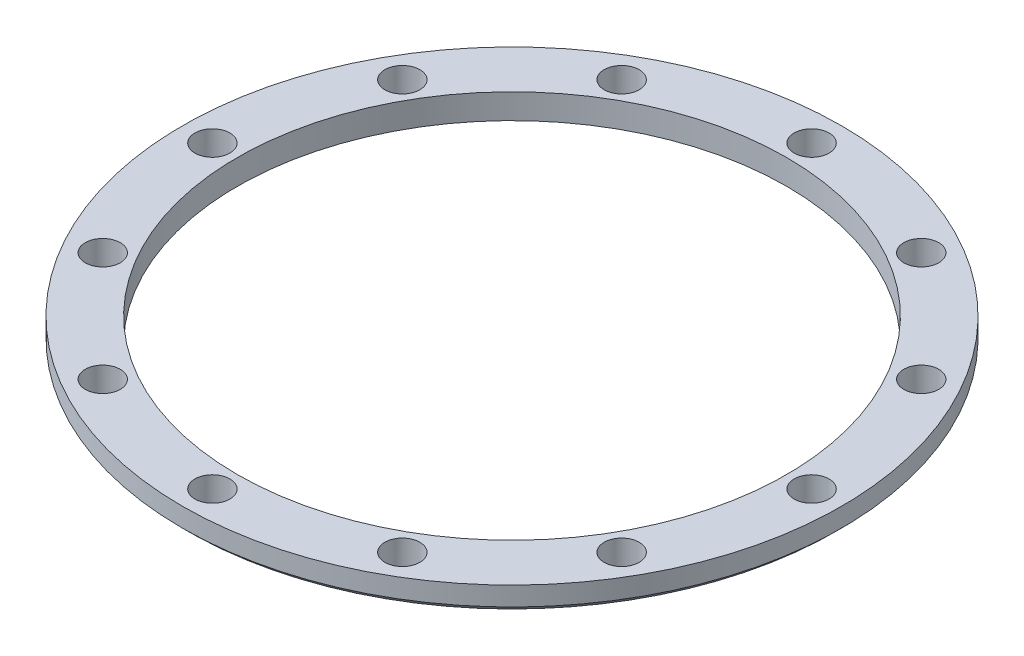
ISO-10303-21;
HEADER;
FILE_DESCRIPTION(('STEP AP214'),'2;1');
FILE_NAME('part.step','',(''),(''),'','','');
FILE_SCHEMA(('AUTOMOTIVE_DESIGN { 1 0 10303 214 1 1 1 1 }'));
ENDSEC;
DATA;
#1=APPLICATION_CONTEXT('core data for automotive mechanical design processes');
#2=APPLICATION_PROTOCOL_DEFINITION('international standard','automotive_design',2000,#1);
#3=PRODUCT_CONTEXT('',#1,'mechanical');
#4=PRODUCT('Part','Part','',(#3));
#5=PRODUCT_RELATED_PRODUCT_CATEGORY('part','',(#4));
#6=PRODUCT_DEFINITION_FORMATION('','',#4);
#7=PRODUCT_DEFINITION_CONTEXT('part definition',#1,'design');
#8=PRODUCT_DEFINITION('design','',#6,#7);
#9=PRODUCT_DEFINITION_SHAPE('','',#8);
#10=(LENGTH_UNIT() NAMED_UNIT(*) SI_UNIT(.MILLI.,.METRE.));
#11=(NAMED_UNIT(*) PLANE_ANGLE_UNIT() SI_UNIT($,.RADIAN.));
#12=(NAMED_UNIT(*) SI_UNIT($,.STERADIAN.) SOLID_ANGLE_UNIT());
#13=UNCERTAINTY_MEASURE_WITH_UNIT(LENGTH_MEASURE(1.E-05),#10,'distance_accuracy_value','');
#14=(GEOMETRIC_REPRESENTATION_CONTEXT(3) GLOBAL_UNCERTAINTY_ASSIGNED_CONTEXT((#13)) GLOBAL_UNIT_ASSIGNED_CONTEXT((#10,
#11,#12)) REPRESENTATION_CONTEXT('',''));
#15=CARTESIAN_POINT('',(0.,0.,0.));
#16=DIRECTION('',(0.,0.,1.));
#17=DIRECTION('',(1.,0.,0.));
#18=AXIS2_PLACEMENT_3D('',#15,#16,#17);
#19=CARTESIAN_POINT('',(15.,-43.,25.9807621135332));
#20=DIRECTION('',(0.,1.,0.));
#21=DIRECTION('',(0.,0.,1.));
#22=AXIS2_PLACEMENT_3D('',#19,#20,#21);
#23=CYLINDRICAL_SURFACE('',#22,1.75000000000326);
#24=CARTESIAN_POINT('',(15.,-43.,25.9807621135332));
#25=DIRECTION('',(0.,-1.,0.));
#26=DIRECTION('',(0.,0.,-1.));
#27=AXIS2_PLACEMENT_3D('',#24,#25,#26);
#28=CIRCLE('',#27,1.75000000000326);
#29=CARTESIAN_POINT('',(15.,-43.,24.2307621135299));
#30=VERTEX_POINT('',#29);
#31=EDGE_CURVE('E42',#30,#30,#28,.T.);
#32=ORIENTED_EDGE('',*,*,#31,.T.);
#33=EDGE_LOOP('',(#32));
#34=FACE_BOUND('',#33,.T.);
#35=CARTESIAN_POINT('',(15.,-40.5,25.9807621135332));
#36=DIRECTION('',(0.,1.,0.));
#37=DIRECTION('',(0.,0.,1.));
#38=AXIS2_PLACEMENT_3D('',#35,#36,#37);
#39=CIRCLE('',#38,1.75000000000326);
#40=CARTESIAN_POINT('',(15.,-40.5,27.7307621135364));
#41=VERTEX_POINT('',#40);
#42=EDGE_CURVE('E89',#41,#41,#39,.T.);
#43=ORIENTED_EDGE('',*,*,#42,.T.);
#44=EDGE_LOOP('',(#43));
#45=FACE_BOUND('',#44,.T.);
#46=ADVANCED_FACE('F31',(#34,#45),#23,.F.);
#47=CARTESIAN_POINT('',(25.9807621135332,-43.,15.));
#48=DIRECTION('',(0.,1.,0.));
#49=DIRECTION('',(0.,0.,1.));
#50=AXIS2_PLACEMENT_3D('',#47,#48,#49);
#51=CYLINDRICAL_SURFACE('',#50,1.75000000000326);
#52=CARTESIAN_POINT('',(25.9807621135332,-43.,15.));
#53=DIRECTION('',(0.,-1.,0.));
#54=DIRECTION('',(0.,0.,-1.));
#55=AXIS2_PLACEMENT_3D('',#52,#53,#54);
#56=CIRCLE('',#55,1.75000000000326);
#57=CARTESIAN_POINT('',(25.9807621135332,-43.,13.2499999999967));
#58=VERTEX_POINT('',#57);
#59=EDGE_CURVE('E46',#58,#58,#56,.T.);
#60=ORIENTED_EDGE('',*,*,#59,.T.);
#61=EDGE_LOOP('',(#60));
#62=FACE_BOUND('',#61,.T.);
#63=CARTESIAN_POINT('',(25.9807621135332,-40.5,15.));
#64=DIRECTION('',(0.,1.,0.));
#65=DIRECTION('',(0.,0.,1.));
#66=AXIS2_PLACEMENT_3D('',#63,#64,#65);
#67=CIRCLE('',#66,1.75000000000326);
#68=CARTESIAN_POINT('',(25.9807621135332,-40.5,16.7500000000033));
#69=VERTEX_POINT('',#68);
#70=EDGE_CURVE('E92',#69,#69,#67,.T.);
#71=ORIENTED_EDGE('',*,*,#70,.T.);
#72=EDGE_LOOP('',(#71));
#73=FACE_BOUND('',#72,.T.);
#74=ADVANCED_FACE('F141',(#62,#73),#51,.F.);
#75=CARTESIAN_POINT('',(30.,-43.,0.));
#76=DIRECTION('',(0.,1.,0.));
#77=DIRECTION('',(0.,0.,1.));
#78=AXIS2_PLACEMENT_3D('',#75,#76,#77);
#79=CYLINDRICAL_SURFACE('',#78,1.75000000000326);
#80=CARTESIAN_POINT('',(30.,-43.,0.));
#81=DIRECTION('',(0.,-1.,0.));
#82=DIRECTION('',(0.,0.,-1.));
#83=AXIS2_PLACEMENT_3D('',#80,#81,#82);
#84=CIRCLE('',#83,1.75000000000326);
#85=CARTESIAN_POINT('',(30.,-43.,-1.75000000000327));
#86=VERTEX_POINT('',#85);
#87=EDGE_CURVE('E56',#86,#86,#84,.T.);
#88=ORIENTED_EDGE('',*,*,#87,.T.);
#89=EDGE_LOOP('',(#88));
#90=FACE_BOUND('',#89,.T.);
#91=CARTESIAN_POINT('',(30.,-40.5,0.));
#92=DIRECTION('',(0.,1.,0.));
#93=DIRECTION('',(0.,0.,1.));
#94=AXIS2_PLACEMENT_3D('',#91,#92,#93);
#95=CIRCLE('',#94,1.75000000000326);
#96=CARTESIAN_POINT('',(30.,-40.5,1.75000000000326));
#97=VERTEX_POINT('',#96);
#98=EDGE_CURVE('E95',#97,#97,#95,.T.);
#99=ORIENTED_EDGE('',*,*,#98,.T.);
#100=EDGE_LOOP('',(#99));
#101=FACE_BOUND('',#100,.T.);
#102=ADVANCED_FACE('F147',(#90,#101),#79,.F.);
#103=CARTESIAN_POINT('',(25.9807621135332,-43.,-15.));
#104=DIRECTION('',(0.,1.,0.));
#105=DIRECTION('',(0.,0.,1.));
#106=AXIS2_PLACEMENT_3D('',#103,#104,#105);
#107=CYLINDRICAL_SURFACE('',#106,1.75000000000326);
#108=CARTESIAN_POINT('',(25.9807621135332,-43.,-15.));
#109=DIRECTION('',(0.,-1.,0.));
#110=DIRECTION('',(0.,0.,-1.));
#111=AXIS2_PLACEMENT_3D('',#108,#109,#110);
#112=CIRCLE('',#111,1.75000000000326);
#113=CARTESIAN_POINT('',(25.9807621135332,-43.,-16.7500000000033));
#114=VERTEX_POINT('',#113);
#115=EDGE_CURVE('E59',#114,#114,#112,.T.);
#116=ORIENTED_EDGE('',*,*,#115,.T.);
#117=EDGE_LOOP('',(#116));
#118=FACE_BOUND('',#117,.T.);
#119=CARTESIAN_POINT('',(25.9807621135332,-40.5,-15.));
#120=DIRECTION('',(0.,1.,0.));
#121=DIRECTION('',(0.,0.,1.));
#122=AXIS2_PLACEMENT_3D('',#119,#120,#121);
#123=CIRCLE('',#122,1.75000000000326);
#124=CARTESIAN_POINT('',(25.9807621135332,-40.5,-13.2499999999967));
#125=VERTEX_POINT('',#124);
#126=EDGE_CURVE('E98',#125,#125,#123,.T.);
#127=ORIENTED_EDGE('',*,*,#126,.T.);
#128=EDGE_LOOP('',(#127));
#129=FACE_BOUND('',#128,.T.);
#130=ADVANCED_FACE('F228',(#118,#129),#107,.F.);
#131=CARTESIAN_POINT('',(15.,-43.,-25.9807621135332));
#132=DIRECTION('',(0.,1.,0.));
#133=DIRECTION('',(0.,0.,1.));
#134=AXIS2_PLACEMENT_3D('',#131,#132,#133);
#135=CYLINDRICAL_SURFACE('',#134,1.75000000000326);
#136=CARTESIAN_POINT('',(15.,-43.,-25.9807621135332));
#137=DIRECTION('',(0.,-1.,0.));
#138=DIRECTION('',(0.,0.,-1.));
#139=AXIS2_PLACEMENT_3D('',#136,#137,#138);
#140=CIRCLE('',#139,1.75000000000326);
#141=CARTESIAN_POINT('',(15.,-43.,-27.7307621135364));
#142=VERTEX_POINT('',#141);
#143=EDGE_CURVE('E62',#142,#142,#140,.T.);
#144=ORIENTED_EDGE('',*,*,#143,.T.);
#145=EDGE_LOOP('',(#144));
#146=FACE_BOUND('',#145,.T.);
#147=CARTESIAN_POINT('',(15.,-40.5,-25.9807621135332));
#148=DIRECTION('',(0.,1.,0.));
#149=DIRECTION('',(0.,0.,1.));
#150=AXIS2_PLACEMENT_3D('',#147,#148,#149);
#151=CIRCLE('',#150,1.75000000000326);
#152=CARTESIAN_POINT('',(15.,-40.5,-24.2307621135299));
#153=VERTEX_POINT('',#152);
#154=EDGE_CURVE('E101',#153,#153,#151,.T.);
#155=ORIENTED_EDGE('',*,*,#154,.T.);
#156=EDGE_LOOP('',(#155));
#157=FACE_BOUND('',#156,.T.);
#158=ADVANCED_FACE('F224',(#146,#157),#135,.F.);
#159=CARTESIAN_POINT('',(0.,-43.,0.));
#160=DIRECTION('',(0.,1.,0.));
#161=DIRECTION('',(0.,0.,1.));
#162=AXIS2_PLACEMENT_3D('',#159,#160,#161);
#163=CYLINDRICAL_SURFACE('',#162,27.5);
#164=CARTESIAN_POINT('',(0.,-43.,0.));
#165=DIRECTION('',(0.,-1.,0.));
#166=DIRECTION('',(0.,0.,-1.));
#167=AXIS2_PLACEMENT_3D('',#164,#165,#166);
#168=CIRCLE('',#167,27.5);
#169=CARTESIAN_POINT('',(0.,-43.,-27.5));
#170=VERTEX_POINT('',#169);
#171=EDGE_CURVE('E65',#170,#170,#168,.T.);
#172=ORIENTED_EDGE('',*,*,#171,.T.);
#173=EDGE_LOOP('',(#172));
#174=FACE_BOUND('',#173,.T.);
#175=CARTESIAN_POINT('',(0.,-40.5,0.));
#176=DIRECTION('',(0.,1.,0.));
#177=DIRECTION('',(0.,0.,1.));
#178=AXIS2_PLACEMENT_3D('',#175,#176,#177);
#179=CIRCLE('',#178,27.5);
#180=CARTESIAN_POINT('',(0.,-40.5,27.5));
#181=VERTEX_POINT('',#180);
#182=EDGE_CURVE('E104',#181,#181,#179,.T.);
#183=ORIENTED_EDGE('',*,*,#182,.T.);
#184=EDGE_LOOP('',(#183));
#185=FACE_BOUND('',#184,.T.);
#186=ADVANCED_FACE('F220',(#174,#185),#163,.F.);
#187=CARTESIAN_POINT('',(0.,-43.,30.));
#188=DIRECTION('',(0.,1.,0.));
#189=DIRECTION('',(0.,0.,1.));
#190=AXIS2_PLACEMENT_3D('',#187,#188,#189);
#191=CYLINDRICAL_SURFACE('',#190,1.75000000000326);
#192=CARTESIAN_POINT('',(0.,-43.,30.));
#193=DIRECTION('',(0.,-1.,0.));
#194=DIRECTION('',(0.,0.,-1.));
#195=AXIS2_PLACEMENT_3D('',#192,#193,#194);
#196=CIRCLE('',#195,1.75000000000326);
#197=CARTESIAN_POINT('',(0.,-43.,28.2499999999967));
#198=VERTEX_POINT('',#197);
#199=EDGE_CURVE('E68',#198,#198,#196,.T.);
#200=ORIENTED_EDGE('',*,*,#199,.T.);
#201=EDGE_LOOP('',(#200));
#202=FACE_BOUND('',#201,.T.);
#203=CARTESIAN_POINT('',(0.,-40.5,30.));
#204=DIRECTION('',(0.,1.,0.));
#205=DIRECTION('',(0.,0.,1.));
#206=AXIS2_PLACEMENT_3D('',#203,#204,#205);
#207=CIRCLE('',#206,1.75000000000326);
#208=CARTESIAN_POINT('',(0.,-40.5,31.7500000000033));
#209=VERTEX_POINT('',#208);
#210=EDGE_CURVE('E107',#209,#209,#207,.T.);
#211=ORIENTED_EDGE('',*,*,#210,.T.);
#212=EDGE_LOOP('',(#211));
#213=FACE_BOUND('',#212,.T.);
#214=ADVANCED_FACE('F216',(#202,#213),#191,.F.);
#215=CARTESIAN_POINT('',(0.,-43.,-30.));
#216=DIRECTION('',(0.,1.,0.));
#217=DIRECTION('',(0.,0.,1.));
#218=AXIS2_PLACEMENT_3D('',#215,#216,#217);
#219=CYLINDRICAL_SURFACE('',#218,1.75000000000326);
#220=CARTESIAN_POINT('',(0.,-43.,-30.));
#221=DIRECTION('',(0.,-1.,0.));
#222=DIRECTION('',(0.,0.,-1.));
#223=AXIS2_PLACEMENT_3D('',#220,#221,#222);
#224=CIRCLE('',#223,1.75000000000326);
#225=CARTESIAN_POINT('',(0.,-43.,-31.7500000000033));
#226=VERTEX_POINT('',#225);
#227=EDGE_CURVE('E71',#226,#226,#224,.T.);
#228=ORIENTED_EDGE('',*,*,#227,.T.);
#229=EDGE_LOOP('',(#228));
#230=FACE_BOUND('',#229,.T.);
#231=CARTESIAN_POINT('',(0.,-40.5,-30.));
#232=DIRECTION('',(0.,1.,0.));
#233=DIRECTION('',(0.,0.,1.));
#234=AXIS2_PLACEMENT_3D('',#231,#232,#233);
#235=CIRCLE('',#234,1.75000000000326);
#236=CARTESIAN_POINT('',(0.,-40.5,-28.2499999999967));
#237=VERTEX_POINT('',#236);
#238=EDGE_CURVE('E110',#237,#237,#235,.T.);
#239=ORIENTED_EDGE('',*,*,#238,.T.);
#240=EDGE_LOOP('',(#239));
#241=FACE_BOUND('',#240,.T.);
#242=ADVANCED_FACE('F212',(#230,#241),#219,.F.);
#243=CARTESIAN_POINT('',(-15.,-43.,-25.9807621135332));
#244=DIRECTION('',(0.,1.,0.));
#245=DIRECTION('',(0.,0.,1.));
#246=AXIS2_PLACEMENT_3D('',#243,#244,#245);
#247=CYLINDRICAL_SURFACE('',#246,1.75000000000326);
#248=CARTESIAN_POINT('',(-15.,-43.,-25.9807621135332));
#249=DIRECTION('',(0.,-1.,0.));
#250=DIRECTION('',(0.,0.,-1.));
#251=AXIS2_PLACEMENT_3D('',#248,#249,#250);
#252=CIRCLE('',#251,1.75000000000326);
#253=CARTESIAN_POINT('',(-15.,-43.,-27.7307621135364));
#254=VERTEX_POINT('',#253);
#255=EDGE_CURVE('E74',#254,#254,#252,.T.);
#256=ORIENTED_EDGE('',*,*,#255,.T.);
#257=EDGE_LOOP('',(#256));
#258=FACE_BOUND('',#257,.T.);
#259=CARTESIAN_POINT('',(-15.,-40.5,-25.9807621135332));
#260=DIRECTION('',(0.,1.,0.));
#261=DIRECTION('',(0.,0.,1.));
#262=AXIS2_PLACEMENT_3D('',#259,#260,#261);
#263=CIRCLE('',#262,1.75000000000326);
#264=CARTESIAN_POINT('',(-15.,-40.5,-24.2307621135299));
#265=VERTEX_POINT('',#264);
#266=EDGE_CURVE('E113',#265,#265,#263,.T.);
#267=ORIENTED_EDGE('',*,*,#266,.T.);
#268=EDGE_LOOP('',(#267));
#269=FACE_BOUND('',#268,.T.);
#270=ADVANCED_FACE('F208',(#258,#269),#247,.F.);
#271=CARTESIAN_POINT('',(-25.9807621135332,-43.,-15.));
#272=DIRECTION('',(0.,1.,0.));
#273=DIRECTION('',(0.,0.,1.));
#274=AXIS2_PLACEMENT_3D('',#271,#272,#273);
#275=CYLINDRICAL_SURFACE('',#274,1.75000000000326);
#276=CARTESIAN_POINT('',(-25.9807621135332,-43.,-15.));
#277=DIRECTION('',(0.,-1.,0.));
#278=DIRECTION('',(0.,0.,-1.));
#279=AXIS2_PLACEMENT_3D('',#276,#277,#278);
#280=CIRCLE('',#279,1.75000000000326);
#281=CARTESIAN_POINT('',(-25.9807621135332,-43.,-16.7500000000033));
#282=VERTEX_POINT('',#281);
#283=EDGE_CURVE('E77',#282,#282,#280,.T.);
#284=ORIENTED_EDGE('',*,*,#283,.T.);
#285=EDGE_LOOP('',(#284));
#286=FACE_BOUND('',#285,.T.);
#287=CARTESIAN_POINT('',(-25.9807621135332,-40.5,-15.));
#288=DIRECTION('',(0.,1.,0.));
#289=DIRECTION('',(0.,0.,1.));
#290=AXIS2_PLACEMENT_3D('',#287,#288,#289);
#291=CIRCLE('',#290,1.75000000000326);
#292=CARTESIAN_POINT('',(-25.9807621135332,-40.5,-13.2499999999967));
#293=VERTEX_POINT('',#292);
#294=EDGE_CURVE('E116',#293,#293,#291,.T.);
#295=ORIENTED_EDGE('',*,*,#294,.T.);
#296=EDGE_LOOP('',(#295));
#297=FACE_BOUND('',#296,.T.);
#298=ADVANCED_FACE('F193',(#286,#297),#275,.F.);
#299=CARTESIAN_POINT('',(-30.,-43.,0.));
#300=DIRECTION('',(0.,1.,0.));
#301=DIRECTION('',(0.,0.,1.));
#302=AXIS2_PLACEMENT_3D('',#299,#300,#301);
#303=CYLINDRICAL_SURFACE('',#302,1.75000000000326);
#304=CARTESIAN_POINT('',(-30.,-43.,0.));
#305=DIRECTION('',(0.,-1.,0.));
#306=DIRECTION('',(0.,0.,-1.));
#307=AXIS2_PLACEMENT_3D('',#304,#305,#306);
#308=CIRCLE('',#307,1.75000000000326);
#309=CARTESIAN_POINT('',(-30.,-43.,-1.75000000000327));
#310=VERTEX_POINT('',#309);
#311=EDGE_CURVE('E80',#310,#310,#308,.T.);
#312=ORIENTED_EDGE('',*,*,#311,.T.);
#313=EDGE_LOOP('',(#312));
#314=FACE_BOUND('',#313,.T.);
#315=CARTESIAN_POINT('',(-30.,-40.5,0.));
#316=DIRECTION('',(0.,1.,0.));
#317=DIRECTION('',(0.,0.,1.));
#318=AXIS2_PLACEMENT_3D('',#315,#316,#317);
#319=CIRCLE('',#318,1.75000000000326);
#320=CARTESIAN_POINT('',(-30.,-40.5,1.75000000000326));
#321=VERTEX_POINT('',#320);
#322=EDGE_CURVE('E119',#321,#321,#319,.T.);
#323=ORIENTED_EDGE('',*,*,#322,.T.);
#324=EDGE_LOOP('',(#323));
#325=FACE_BOUND('',#324,.T.);
#326=ADVANCED_FACE('F190',(#314,#325),#303,.F.);
#327=CARTESIAN_POINT('',(-25.9807621135332,-43.,15.));
#328=DIRECTION('',(0.,1.,0.));
#329=DIRECTION('',(0.,0.,1.));
#330=AXIS2_PLACEMENT_3D('',#327,#328,#329);
#331=CYLINDRICAL_SURFACE('',#330,1.75000000000326);
#332=CARTESIAN_POINT('',(-25.9807621135332,-43.,15.));
#333=DIRECTION('',(0.,-1.,0.));
#334=DIRECTION('',(0.,0.,-1.));
#335=AXIS2_PLACEMENT_3D('',#332,#333,#334);
#336=CIRCLE('',#335,1.75000000000326);
#337=CARTESIAN_POINT('',(-25.9807621135332,-43.,13.2499999999967));
#338=VERTEX_POINT('',#337);
#339=EDGE_CURVE('E83',#338,#338,#336,.T.);
#340=ORIENTED_EDGE('',*,*,#339,.T.);
#341=EDGE_LOOP('',(#340));
#342=FACE_BOUND('',#341,.T.);
#343=CARTESIAN_POINT('',(-25.9807621135332,-40.5,15.));
#344=DIRECTION('',(0.,1.,0.));
#345=DIRECTION('',(0.,0.,1.));
#346=AXIS2_PLACEMENT_3D('',#343,#344,#345);
#347=CIRCLE('',#346,1.75000000000326);
#348=CARTESIAN_POINT('',(-25.9807621135332,-40.5,16.7500000000032));
#349=VERTEX_POINT('',#348);
#350=EDGE_CURVE('E51',#349,#349,#347,.T.);
#351=ORIENTED_EDGE('',*,*,#350,.T.);
#352=EDGE_LOOP('',(#351));
#353=FACE_BOUND('',#352,.T.);
#354=ADVANCED_FACE('F157',(#342,#353),#331,.F.);
#355=CARTESIAN_POINT('',(-15.,-43.,25.9807621135332));
#356=DIRECTION('',(0.,1.,0.));
#357=DIRECTION('',(0.,0.,1.));
#358=AXIS2_PLACEMENT_3D('',#355,#356,#357);
#359=CYLINDRICAL_SURFACE('',#358,1.75000000000326);
#360=CARTESIAN_POINT('',(-15.,-43.,25.9807621135332));
#361=DIRECTION('',(0.,-1.,0.));
#362=DIRECTION('',(0.,0.,-1.));
#363=AXIS2_PLACEMENT_3D('',#360,#361,#362);
#364=CIRCLE('',#363,1.75000000000326);
#365=CARTESIAN_POINT('',(-15.,-43.,24.2307621135299));
#366=VERTEX_POINT('',#365);
#367=EDGE_CURVE('E86',#366,#366,#364,.T.);
#368=ORIENTED_EDGE('',*,*,#367,.T.);
#369=EDGE_LOOP('',(#368));
#370=FACE_BOUND('',#369,.T.);
#371=CARTESIAN_POINT('',(-15.,-40.5,25.9807621135332));
#372=DIRECTION('',(0.,1.,0.));
#373=DIRECTION('',(0.,0.,1.));
#374=AXIS2_PLACEMENT_3D('',#371,#372,#373);
#375=CIRCLE('',#374,1.75000000000326);
#376=CARTESIAN_POINT('',(-15.,-40.5,27.7307621135364));
#377=VERTEX_POINT('',#376);
#378=EDGE_CURVE('E49',#377,#377,#375,.T.);
#379=ORIENTED_EDGE('',*,*,#378,.T.);
#380=EDGE_LOOP('',(#379));
#381=FACE_BOUND('',#380,.T.);
#382=ADVANCED_FACE('F153',(#370,#381),#359,.F.);
#383=CARTESIAN_POINT('',(0.,-43.,0.));
#384=DIRECTION('',(0.,-1.,0.));
#385=DIRECTION('',(0.,0.,-1.));
#386=AXIS2_PLACEMENT_3D('',#383,#384,#385);
#387=PLANE('',#386);
#388=CARTESIAN_POINT('',(0.,-43.,0.));
#389=DIRECTION('',(0.,-1.,0.));
#390=DIRECTION('',(0.,0.,-1.));
#391=AXIS2_PLACEMENT_3D('',#388,#389,#390);
#392=CIRCLE('',#391,32.4);
#393=CARTESIAN_POINT('',(0.,-43.,-32.4));
#394=VERTEX_POINT('',#393);
#395=EDGE_CURVE('E10',#394,#394,#392,.T.);
#396=ORIENTED_EDGE('',*,*,#395,.T.);
#397=EDGE_LOOP('',(#396));
#398=FACE_BOUND('',#397,.T.);
#399=ORIENTED_EDGE('',*,*,#339,.F.);
#400=EDGE_LOOP('',(#399));
#401=FACE_BOUND('',#400,.T.);
#402=ORIENTED_EDGE('',*,*,#283,.F.);
#403=EDGE_LOOP('',(#402));
#404=FACE_BOUND('',#403,.T.);
#405=ORIENTED_EDGE('',*,*,#227,.F.);
#406=EDGE_LOOP('',(#405));
#407=FACE_BOUND('',#406,.T.);
#408=ORIENTED_EDGE('',*,*,#171,.F.);
#409=EDGE_LOOP('',(#408));
#410=FACE_BOUND('',#409,.T.);
#411=ORIENTED_EDGE('',*,*,#115,.F.);
#412=EDGE_LOOP('',(#411));
#413=FACE_BOUND('',#412,.T.);
#414=ORIENTED_EDGE('',*,*,#59,.F.);
#415=EDGE_LOOP('',(#414));
#416=FACE_BOUND('',#415,.T.);
#417=ORIENTED_EDGE('',*,*,#31,.F.);
#418=EDGE_LOOP('',(#417));
#419=FACE_BOUND('',#418,.T.);
#420=ORIENTED_EDGE('',*,*,#87,.F.);
#421=EDGE_LOOP('',(#420));
#422=FACE_BOUND('',#421,.T.);
#423=ORIENTED_EDGE('',*,*,#143,.F.);
#424=EDGE_LOOP('',(#423));
#425=FACE_BOUND('',#424,.T.);
#426=ORIENTED_EDGE('',*,*,#199,.F.);
#427=EDGE_LOOP('',(#426));
#428=FACE_BOUND('',#427,.T.);
#429=ORIENTED_EDGE('',*,*,#255,.F.);
#430=EDGE_LOOP('',(#429));
#431=FACE_BOUND('',#430,.T.);
#432=ORIENTED_EDGE('',*,*,#311,.F.);
#433=EDGE_LOOP('',(#432));
#434=FACE_BOUND('',#433,.T.);
#435=ORIENTED_EDGE('',*,*,#367,.F.);
#436=EDGE_LOOP('',(#435));
#437=FACE_BOUND('',#436,.T.);
#438=ADVANCED_FACE('F137',(#398,#401,#404,#407,#410,#413,#416,#419,#422,#425,#428,#431,#434,
#437),#387,.T.);
#439=CARTESIAN_POINT('',(0.,-40.5,0.));
#440=DIRECTION('',(0.,1.,0.));
#441=DIRECTION('',(0.,0.,1.));
#442=AXIS2_PLACEMENT_3D('',#439,#440,#441);
#443=PLANE('',#442);
#444=ORIENTED_EDGE('',*,*,#42,.F.);
#445=EDGE_LOOP('',(#444));
#446=FACE_BOUND('',#445,.T.);
#447=ORIENTED_EDGE('',*,*,#70,.F.);
#448=EDGE_LOOP('',(#447));
#449=FACE_BOUND('',#448,.T.);
#450=ORIENTED_EDGE('',*,*,#98,.F.);
#451=EDGE_LOOP('',(#450));
#452=FACE_BOUND('',#451,.T.);
#453=ORIENTED_EDGE('',*,*,#126,.F.);
#454=EDGE_LOOP('',(#453));
#455=FACE_BOUND('',#454,.T.);
#456=ORIENTED_EDGE('',*,*,#154,.F.);
#457=EDGE_LOOP('',(#456));
#458=FACE_BOUND('',#457,.T.);
#459=ORIENTED_EDGE('',*,*,#182,.F.);
#460=EDGE_LOOP('',(#459));
#461=FACE_BOUND('',#460,.T.);
#462=ORIENTED_EDGE('',*,*,#210,.F.);
#463=EDGE_LOOP('',(#462));
#464=FACE_BOUND('',#463,.T.);
#465=ORIENTED_EDGE('',*,*,#238,.F.);
#466=EDGE_LOOP('',(#465));
#467=FACE_BOUND('',#466,.T.);
#468=ORIENTED_EDGE('',*,*,#266,.F.);
#469=EDGE_LOOP('',(#468));
#470=FACE_BOUND('',#469,.T.);
#471=ORIENTED_EDGE('',*,*,#294,.F.);
#472=EDGE_LOOP('',(#471));
#473=FACE_BOUND('',#472,.T.);
#474=ORIENTED_EDGE('',*,*,#322,.F.);
#475=EDGE_LOOP('',(#474));
#476=FACE_BOUND('',#475,.T.);
#477=ORIENTED_EDGE('',*,*,#350,.F.);
#478=EDGE_LOOP('',(#477));
#479=FACE_BOUND('',#478,.T.);
#480=ORIENTED_EDGE('',*,*,#378,.F.);
#481=EDGE_LOOP('',(#480));
#482=FACE_BOUND('',#481,.T.);
#483=CARTESIAN_POINT('',(0.,-40.5,0.));
#484=DIRECTION('',(0.,1.,0.));
#485=DIRECTION('',(0.,0.,1.));
#486=AXIS2_PLACEMENT_3D('',#483,#484,#485);
#487=CIRCLE('',#486,33.);
#488=CARTESIAN_POINT('',(0.,-40.5,33.));
#489=VERTEX_POINT('',#488);
#490=EDGE_CURVE('E52',#489,#489,#487,.T.);
#491=ORIENTED_EDGE('',*,*,#490,.T.);
#492=EDGE_LOOP('',(#491));
#493=FACE_BOUND('',#492,.T.);
#494=ADVANCED_FACE('F127',(#446,#449,#452,#455,#458,#461,#464,#467,#470,#473,#476,#479,#482,
#493),#443,.T.);
#495=CARTESIAN_POINT('',(0.,-136.338095116624,0.));
#496=DIRECTION('',(0.,1.,0.));
#497=DIRECTION('',(0.,0.,1.));
#498=AXIS2_PLACEMENT_3D('',#495,#496,#497);
#499=CYLINDRICAL_SURFACE('',#498,33.);
#500=CARTESIAN_POINT('',(0.,-42.4,0.));
#501=DIRECTION('',(0.,-1.,0.));
#502=DIRECTION('',(0.,0.,-1.));
#503=AXIS2_PLACEMENT_3D('',#500,#501,#502);
#504=CIRCLE('',#503,33.);
#505=CARTESIAN_POINT('',(0.,-42.4,-33.));
#506=VERTEX_POINT('',#505);
#507=EDGE_CURVE('E38',#506,#506,#504,.F.);
#508=ORIENTED_EDGE('',*,*,#507,.T.);
#509=EDGE_LOOP('',(#508));
#510=FACE_BOUND('',#509,.T.);
#511=ORIENTED_EDGE('',*,*,#490,.F.);
#512=EDGE_LOOP('',(#511));
#513=FACE_BOUND('',#512,.T.);
#514=ADVANCED_FACE('F129',(#510,#513),#499,.T.);
#515=CARTESIAN_POINT('',(0.,-42.4,0.));
#516=DIRECTION('',(0.,1.,0.));
#517=DIRECTION('',(0.,0.,1.));
#518=AXIS2_PLACEMENT_3D('',#515,#516,#517);
#519=CONICAL_SURFACE('',#518,33.,0.785398163397448);
#520=ORIENTED_EDGE('',*,*,#395,.F.);
#521=EDGE_LOOP('',(#520));
#522=FACE_BOUND('',#521,.T.);
#523=ORIENTED_EDGE('',*,*,#507,.F.);
#524=EDGE_LOOP('',(#523));
#525=FACE_BOUND('',#524,.T.);
#526=ADVANCED_FACE('F33',(#522,#525),#519,.T.);
#527=CLOSED_SHELL('',(#46,#74,#102,#130,#158,#186,#214,#242,#270,#298,#326,#354,#382,#438,#494,
#514,#526));
#528=MANIFOLD_SOLID_BREP('B2',#527);
#529=ADVANCED_BREP_SHAPE_REPRESENTATION('',(#18,#528),#14);
#530=SHAPE_DEFINITION_REPRESENTATION(#9,#529);
ENDSEC;
END-ISO-10303-21;
